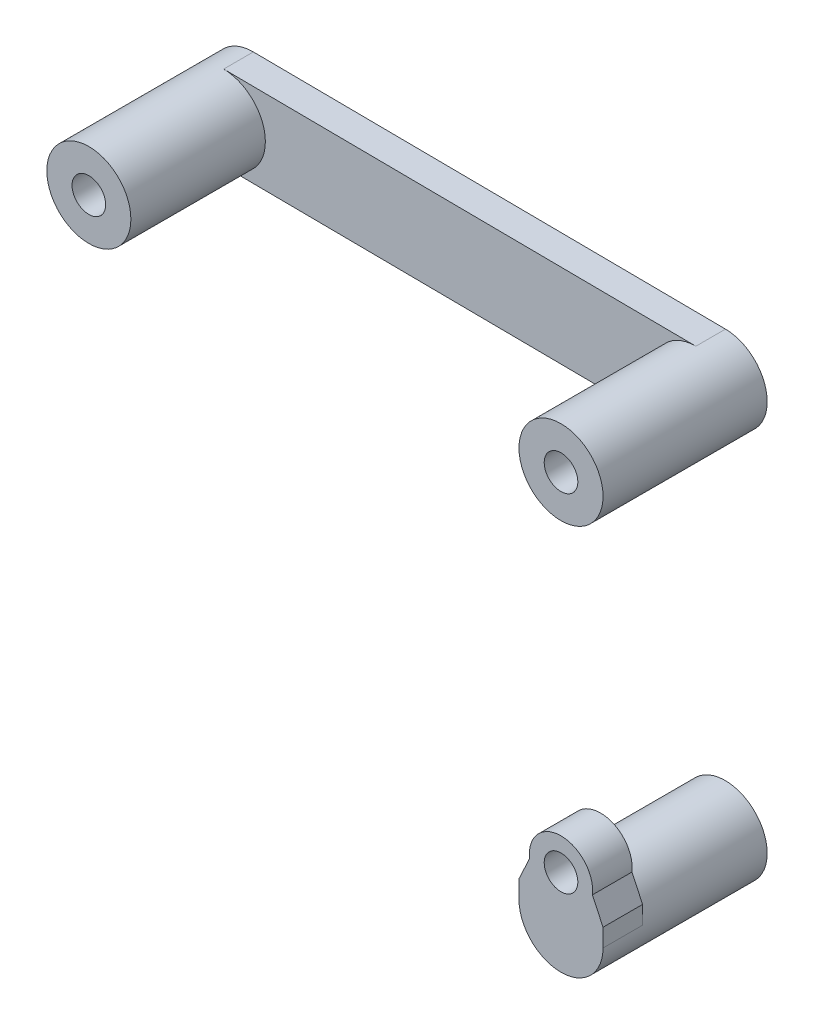
ISO-10303-21;
HEADER;
FILE_DESCRIPTION(('STEP AP214'),'2;1');
FILE_NAME('part.step','',(''),(''),'','','');
FILE_SCHEMA(('AUTOMOTIVE_DESIGN { 1 0 10303 214 1 1 1 1 }'));
ENDSEC;
DATA;
#1=APPLICATION_CONTEXT('core data for automotive mechanical design processes');
#2=APPLICATION_PROTOCOL_DEFINITION('international standard','automotive_design',2000,#1);
#3=PRODUCT_CONTEXT('',#1,'mechanical');
#4=PRODUCT('Part','Part','',(#3));
#5=PRODUCT_RELATED_PRODUCT_CATEGORY('part','',(#4));
#6=PRODUCT_DEFINITION_FORMATION('','',#4);
#7=PRODUCT_DEFINITION_CONTEXT('part definition',#1,'design');
#8=PRODUCT_DEFINITION('design','',#6,#7);
#9=PRODUCT_DEFINITION_SHAPE('','',#8);
#10=(LENGTH_UNIT() NAMED_UNIT(*) SI_UNIT(.MILLI.,.METRE.));
#11=(NAMED_UNIT(*) PLANE_ANGLE_UNIT() SI_UNIT($,.RADIAN.));
#12=(NAMED_UNIT(*) SI_UNIT($,.STERADIAN.) SOLID_ANGLE_UNIT());
#13=UNCERTAINTY_MEASURE_WITH_UNIT(LENGTH_MEASURE(1.E-05),#10,'distance_accuracy_value','');
#14=(GEOMETRIC_REPRESENTATION_CONTEXT(3) GLOBAL_UNCERTAINTY_ASSIGNED_CONTEXT((#13)) GLOBAL_UNIT_ASSIGNED_CONTEXT((#10,
#11,#12)) REPRESENTATION_CONTEXT('',''));
#15=CARTESIAN_POINT('',(0.,0.,0.));
#16=DIRECTION('',(0.,0.,1.));
#17=DIRECTION('',(1.,0.,0.));
#18=AXIS2_PLACEMENT_3D('',#15,#16,#17);
#19=CARTESIAN_POINT('',(77.375,15.9832501717132,0.));
#20=DIRECTION('',(0.,0.,-1.));
#21=DIRECTION('',(-1.,0.,0.));
#22=AXIS2_PLACEMENT_3D('',#19,#20,#21);
#23=PLANE('',#22);
#24=CARTESIAN_POINT('',(77.375,15.9832501717132,0.));
#25=DIRECTION('',(0.,0.,-1.));
#26=DIRECTION('',(-1.,0.,0.));
#27=AXIS2_PLACEMENT_3D('',#24,#25,#26);
#28=CIRCLE('',#27,2.1);
#29=CARTESIAN_POINT('',(75.275,15.9832501717132,0.));
#30=VERTEX_POINT('',#29);
#31=EDGE_CURVE('E124',#30,#30,#28,.T.);
#32=ORIENTED_EDGE('',*,*,#31,.F.);
#33=EDGE_LOOP('',(#32));
#34=FACE_BOUND('',#33,.T.);
#35=CARTESIAN_POINT('',(29.625,16.3832501717124,0.));
#36=DIRECTION('',(0.,0.,-1.));
#37=DIRECTION('',(-1.,0.,0.));
#38=AXIS2_PLACEMENT_3D('',#35,#36,#37);
#39=CIRCLE('',#38,2.1);
#40=CARTESIAN_POINT('',(27.525,16.3832501717124,0.));
#41=VERTEX_POINT('',#40);
#42=EDGE_CURVE('E133',#41,#41,#39,.T.);
#43=ORIENTED_EDGE('',*,*,#42,.F.);
#44=EDGE_LOOP('',(#43));
#45=FACE_BOUND('',#44,.T.);
#46=CARTESIAN_POINT('',(77.375,15.9832501717132,0.));
#47=DIRECTION('',(0.,0.,-1.));
#48=DIRECTION('',(-1.,0.,0.));
#49=AXIS2_PLACEMENT_3D('',#46,#47,#48);
#50=CIRCLE('',#49,4.25000000000001);
#51=CARTESIAN_POINT('',(77.4106008451444,20.2331010608415,0.));
#52=VERTEX_POINT('',#51);
#53=CARTESIAN_POINT('',(77.3393991548555,11.7333992825848,0.));
#54=VERTEX_POINT('',#53);
#55=EDGE_CURVE('E109',#52,#54,#50,.T.);
#56=ORIENTED_EDGE('',*,*,#55,.T.);
#57=DIRECTION('',(-0.999964915089023,0.00837666944575508,0.));
#58=VECTOR('',#57,1.);
#59=CARTESIAN_POINT('',(77.3393991548555,11.7333992825848,0.));
#60=LINE('',#59,#58);
#61=CARTESIAN_POINT('',(29.5893991548555,12.133399282584,0.));
#62=VERTEX_POINT('',#61);
#63=EDGE_CURVE('E143',#54,#62,#60,.T.);
#64=ORIENTED_EDGE('',*,*,#63,.T.);
#65=CARTESIAN_POINT('',(29.625,16.3832501717124,0.));
#66=DIRECTION('',(0.,0.,-1.));
#67=DIRECTION('',(-1.,0.,0.));
#68=AXIS2_PLACEMENT_3D('',#65,#66,#67);
#69=CIRCLE('',#68,4.24999999999999);
#70=CARTESIAN_POINT('',(29.6606008451444,20.6331010608407,0.));
#71=VERTEX_POINT('',#70);
#72=EDGE_CURVE('E53',#62,#71,#69,.T.);
#73=ORIENTED_EDGE('',*,*,#72,.T.);
#74=DIRECTION('',(0.999964915089023,-0.00837666944575472,0.));
#75=VECTOR('',#74,1.);
#76=CARTESIAN_POINT('',(77.4106008451444,20.2331010608415,0.));
#77=LINE('',#76,#75);
#78=EDGE_CURVE('E119',#71,#52,#77,.T.);
#79=ORIENTED_EDGE('',*,*,#78,.T.);
#80=EDGE_LOOP('',(#56,#64,#73,#79));
#81=FACE_BOUND('',#80,.T.);
#82=ADVANCED_FACE('F50',(#34,#45,#81),#23,.T.);
#83=CARTESIAN_POINT('',(77.375,15.9832501717132,28.620815280171));
#84=DIRECTION('',(0.,0.,-1.));
#85=DIRECTION('',(-1.,0.,0.));
#86=AXIS2_PLACEMENT_3D('',#83,#84,#85);
#87=CYLINDRICAL_SURFACE('',#86,4.25);
#88=CARTESIAN_POINT('',(77.375,15.9832501717132,3.));
#89=DIRECTION('',(0.,0.,1.));
#90=DIRECTION('',(1.,0.,0.));
#91=AXIS2_PLACEMENT_3D('',#88,#89,#90);
#92=CIRCLE('',#91,4.25);
#93=CARTESIAN_POINT('',(77.4106008451444,20.2331010608415,3.));
#94=VERTEX_POINT('',#93);
#95=CARTESIAN_POINT('',(77.3393991548555,11.7333992825848,3.));
#96=VERTEX_POINT('',#95);
#97=EDGE_CURVE('E86',#94,#96,#92,.T.);
#98=ORIENTED_EDGE('',*,*,#97,.T.);
#99=DIRECTION('',(0.,0.,1.));
#100=VECTOR('',#99,1.);
#101=CARTESIAN_POINT('',(77.3393991548555,11.7333992825848,-69.4818334965867));
#102=LINE('',#101,#100);
#103=EDGE_CURVE('E13',#54,#96,#102,.T.);
#104=ORIENTED_EDGE('',*,*,#103,.F.);
#105=ORIENTED_EDGE('',*,*,#55,.F.);
#106=DIRECTION('',(0.,0.,-1.));
#107=VECTOR('',#106,1.);
#108=CARTESIAN_POINT('',(77.4106008451444,20.2331010608415,51.6422863653137));
#109=LINE('',#108,#107);
#110=EDGE_CURVE('E101',#94,#52,#109,.T.);
#111=ORIENTED_EDGE('',*,*,#110,.F.);
#112=EDGE_LOOP('',(#98,#104,#105,#111));
#113=FACE_BOUND('',#112,.T.);
#114=CARTESIAN_POINT('',(77.375,15.9832501717132,16.5999999999992));
#115=DIRECTION('',(0.,0.,-1.));
#116=DIRECTION('',(0.,1.,0.));
#117=AXIS2_PLACEMENT_3D('',#114,#115,#116);
#118=CIRCLE('',#117,4.25);
#119=CARTESIAN_POINT('',(77.375,20.2332501717132,16.5999999999991));
#120=VERTEX_POINT('',#119);
#121=EDGE_CURVE('E95',#120,#120,#118,.T.);
#122=ORIENTED_EDGE('',*,*,#121,.T.);
#123=EDGE_LOOP('',(#122));
#124=FACE_BOUND('',#123,.T.);
#125=ADVANCED_FACE('F106',(#113,#124),#87,.T.);
#126=CARTESIAN_POINT('',(53.5000000000003,-1.31674982828628,16.5999999999997));
#127=DIRECTION('',(0.,0.,-1.));
#128=DIRECTION('',(1.,0.,0.));
#129=AXIS2_PLACEMENT_3D('',#126,#127,#128);
#130=PLANE('',#129);
#131=CARTESIAN_POINT('',(77.375,15.9832501717132,16.6000000000002));
#132=DIRECTION('',(0.,0.,1.));
#133=DIRECTION('',(-1.,0.,0.));
#134=AXIS2_PLACEMENT_3D('',#131,#132,#133);
#135=CIRCLE('',#134,1.7);
#136=CARTESIAN_POINT('',(75.675,15.9832501717132,16.6000000000002));
#137=VERTEX_POINT('',#136);
#138=EDGE_CURVE('E125',#137,#137,#135,.T.);
#139=ORIENTED_EDGE('',*,*,#138,.F.);
#140=EDGE_LOOP('',(#139));
#141=FACE_BOUND('',#140,.T.);
#142=ORIENTED_EDGE('',*,*,#121,.F.);
#143=EDGE_LOOP('',(#142));
#144=FACE_BOUND('',#143,.T.);
#145=ADVANCED_FACE('F157',(#141,#144),#130,.F.);
#146=CARTESIAN_POINT('',(0.,0.,3.));
#147=DIRECTION('',(0.,0.,1.));
#148=DIRECTION('',(1.,0.,0.));
#149=AXIS2_PLACEMENT_3D('',#146,#147,#148);
#150=PLANE('',#149);
#151=DIRECTION('',(-0.999964915089023,0.00837666944575472,0.));
#152=VECTOR('',#151,1.);
#153=CARTESIAN_POINT('',(29.5893991548555,12.133399282584,3.));
#154=LINE('',#153,#152);
#155=CARTESIAN_POINT('',(29.5893991548555,12.133399282584,3.));
#156=VERTEX_POINT('',#155);
#157=EDGE_CURVE('E67',#96,#156,#154,.T.);
#158=ORIENTED_EDGE('',*,*,#157,.F.);
#159=ORIENTED_EDGE('',*,*,#97,.F.);
#160=DIRECTION('',(0.999964915089023,-0.00837666944575472,0.));
#161=VECTOR('',#160,1.);
#162=CARTESIAN_POINT('',(77.4106008451444,20.2331010608415,3.));
#163=LINE('',#162,#161);
#164=CARTESIAN_POINT('',(29.6606008451444,20.6331010608407,3.));
#165=VERTEX_POINT('',#164);
#166=EDGE_CURVE('E89',#165,#94,#163,.T.);
#167=ORIENTED_EDGE('',*,*,#166,.F.);
#168=CARTESIAN_POINT('',(29.625,16.3832501717124,3.));
#169=DIRECTION('',(0.,0.,1.));
#170=DIRECTION('',(1.,0.,0.));
#171=AXIS2_PLACEMENT_3D('',#168,#169,#170);
#172=CIRCLE('',#171,4.25);
#173=EDGE_CURVE('E150',#156,#165,#172,.T.);
#174=ORIENTED_EDGE('',*,*,#173,.F.);
#175=EDGE_LOOP('',(#158,#159,#167,#174));
#176=FACE_BOUND('',#175,.T.);
#177=ADVANCED_FACE('F88',(#176),#150,.T.);
#178=CARTESIAN_POINT('',(29.625,16.3832501717124,28.620815280171));
#179=DIRECTION('',(0.,0.,-1.));
#180=DIRECTION('',(-1.,0.,0.));
#181=AXIS2_PLACEMENT_3D('',#178,#179,#180);
#182=CYLINDRICAL_SURFACE('',#181,4.25);
#183=DIRECTION('',(0.,0.,1.));
#184=VECTOR('',#183,1.);
#185=CARTESIAN_POINT('',(29.5893991548555,12.133399282584,-69.4818334965867));
#186=LINE('',#185,#184);
#187=EDGE_CURVE('E59',#62,#156,#186,.T.);
#188=ORIENTED_EDGE('',*,*,#187,.T.);
#189=ORIENTED_EDGE('',*,*,#173,.T.);
#190=DIRECTION('',(0.,0.,-1.));
#191=VECTOR('',#190,1.);
#192=CARTESIAN_POINT('',(29.6606008451444,20.6331010608407,51.6422863653137));
#193=LINE('',#192,#191);
#194=EDGE_CURVE('E104',#165,#71,#193,.T.);
#195=ORIENTED_EDGE('',*,*,#194,.T.);
#196=ORIENTED_EDGE('',*,*,#72,.F.);
#197=EDGE_LOOP('',(#188,#189,#195,#196));
#198=FACE_BOUND('',#197,.T.);
#199=CARTESIAN_POINT('',(29.625,16.3832501717124,16.5999999999997));
#200=DIRECTION('',(0.,0.,-1.));
#201=DIRECTION('',(0.,1.,0.));
#202=AXIS2_PLACEMENT_3D('',#199,#200,#201);
#203=CIRCLE('',#202,4.25);
#204=CARTESIAN_POINT('',(29.625,20.6332501717124,16.5999999999996));
#205=VERTEX_POINT('',#204);
#206=EDGE_CURVE('E94',#205,#205,#203,.T.);
#207=ORIENTED_EDGE('',*,*,#206,.T.);
#208=EDGE_LOOP('',(#207));
#209=FACE_BOUND('',#208,.T.);
#210=ADVANCED_FACE('F148',(#198,#209),#182,.T.);
#211=CARTESIAN_POINT('',(53.5000000000003,-1.31674982828628,16.5999999999997));
#212=DIRECTION('',(0.,0.,-1.));
#213=DIRECTION('',(1.,0.,0.));
#214=AXIS2_PLACEMENT_3D('',#211,#212,#213);
#215=PLANE('',#214);
#216=CARTESIAN_POINT('',(29.625,16.3832501717124,16.6000000000002));
#217=DIRECTION('',(0.,0.,1.));
#218=DIRECTION('',(1.,0.,0.));
#219=AXIS2_PLACEMENT_3D('',#216,#217,#218);
#220=CIRCLE('',#219,1.7);
#221=CARTESIAN_POINT('',(31.325,16.3832501717124,16.6000000000002));
#222=VERTEX_POINT('',#221);
#223=EDGE_CURVE('E110',#222,#222,#220,.T.);
#224=ORIENTED_EDGE('',*,*,#223,.F.);
#225=EDGE_LOOP('',(#224));
#226=FACE_BOUND('',#225,.T.);
#227=ORIENTED_EDGE('',*,*,#206,.F.);
#228=EDGE_LOOP('',(#227));
#229=FACE_BOUND('',#228,.T.);
#230=ADVANCED_FACE('F216',(#226,#229),#215,.F.);
#231=CARTESIAN_POINT('',(29.5893991548555,12.133399282584,51.6422863653137));
#232=DIRECTION('',(-0.00837666944575472,-0.999964915089023,0.));
#233=DIRECTION('',(0.999964915089023,-0.00837666944575472,0.));
#234=AXIS2_PLACEMENT_3D('',#231,#232,#233);
#235=PLANE('',#234);
#236=ORIENTED_EDGE('',*,*,#187,.F.);
#237=ORIENTED_EDGE('',*,*,#63,.F.);
#238=ORIENTED_EDGE('',*,*,#103,.T.);
#239=ORIENTED_EDGE('',*,*,#157,.T.);
#240=EDGE_LOOP('',(#236,#237,#238,#239));
#241=FACE_BOUND('',#240,.T.);
#242=ADVANCED_FACE('F213',(#241),#235,.T.);
#243=CARTESIAN_POINT('',(77.4106008451444,20.2331010608415,51.6422863653137));
#244=DIRECTION('',(0.00837666944575472,0.999964915089023,0.));
#245=DIRECTION('',(-0.999964915089023,0.00837666944575472,0.));
#246=AXIS2_PLACEMENT_3D('',#243,#244,#245);
#247=PLANE('',#246);
#248=ORIENTED_EDGE('',*,*,#194,.F.);
#249=ORIENTED_EDGE('',*,*,#166,.T.);
#250=ORIENTED_EDGE('',*,*,#110,.T.);
#251=ORIENTED_EDGE('',*,*,#78,.F.);
#252=EDGE_LOOP('',(#248,#249,#250,#251));
#253=FACE_BOUND('',#252,.T.);
#254=ADVANCED_FACE('F99',(#253),#247,.T.);
#255=CARTESIAN_POINT('',(29.625,16.3832501717124,12.6000000000002));
#256=DIRECTION('',(0.,0.,1.));
#257=DIRECTION('',(1.,0.,0.));
#258=AXIS2_PLACEMENT_3D('',#255,#256,#257);
#259=CYLINDRICAL_SURFACE('',#258,1.7);
#260=CARTESIAN_POINT('',(29.625,16.3832501717124,12.6000000000002));
#261=DIRECTION('',(0.,0.,1.));
#262=DIRECTION('',(1.,0.,0.));
#263=AXIS2_PLACEMENT_3D('',#260,#261,#262);
#264=CIRCLE('',#263,1.7);
#265=CARTESIAN_POINT('',(31.325,16.3832501717124,12.6000000000002));
#266=VERTEX_POINT('',#265);
#267=EDGE_CURVE('E113',#266,#266,#264,.T.);
#268=ORIENTED_EDGE('',*,*,#267,.F.);
#269=EDGE_LOOP('',(#268));
#270=FACE_BOUND('',#269,.T.);
#271=ORIENTED_EDGE('',*,*,#223,.T.);
#272=EDGE_LOOP('',(#271));
#273=FACE_BOUND('',#272,.T.);
#274=ADVANCED_FACE('F200',(#270,#273),#259,.F.);
#275=CARTESIAN_POINT('',(29.625,16.3832501717124,12.6000000000002));
#276=DIRECTION('',(0.,0.,1.));
#277=DIRECTION('',(1.,0.,0.));
#278=AXIS2_PLACEMENT_3D('',#275,#276,#277);
#279=PLANE('',#278);
#280=ORIENTED_EDGE('',*,*,#267,.T.);
#281=EDGE_LOOP('',(#280));
#282=FACE_BOUND('',#281,.T.);
#283=ADVANCED_FACE('F196',(#282),#279,.T.);
#284=CARTESIAN_POINT('',(77.375,15.9832501717132,12.6000000000002));
#285=DIRECTION('',(0.,0.,1.));
#286=DIRECTION('',(1.,0.,0.));
#287=AXIS2_PLACEMENT_3D('',#284,#285,#286);
#288=CYLINDRICAL_SURFACE('',#287,1.7);
#289=CARTESIAN_POINT('',(77.375,15.9832501717132,12.6000000000002));
#290=DIRECTION('',(0.,0.,1.));
#291=DIRECTION('',(-1.,0.,0.));
#292=AXIS2_PLACEMENT_3D('',#289,#290,#291);
#293=CIRCLE('',#292,1.7);
#294=CARTESIAN_POINT('',(75.675,15.9832501717132,12.6000000000002));
#295=VERTEX_POINT('',#294);
#296=EDGE_CURVE('E121',#295,#295,#293,.T.);
#297=ORIENTED_EDGE('',*,*,#296,.F.);
#298=EDGE_LOOP('',(#297));
#299=FACE_BOUND('',#298,.T.);
#300=ORIENTED_EDGE('',*,*,#138,.T.);
#301=EDGE_LOOP('',(#300));
#302=FACE_BOUND('',#301,.T.);
#303=ADVANCED_FACE('F199',(#299,#302),#288,.F.);
#304=CARTESIAN_POINT('',(77.375,15.9832501717132,12.6000000000002));
#305=DIRECTION('',(0.,0.,-1.));
#306=DIRECTION('',(-1.,0.,0.));
#307=AXIS2_PLACEMENT_3D('',#304,#305,#306);
#308=PLANE('',#307);
#309=ORIENTED_EDGE('',*,*,#296,.T.);
#310=EDGE_LOOP('',(#309));
#311=FACE_BOUND('',#310,.T.);
#312=ADVANCED_FACE('F193',(#311),#308,.F.);
#313=CARTESIAN_POINT('',(77.375,15.9832501717132,5.7));
#314=DIRECTION('',(0.,0.,-1.));
#315=DIRECTION('',(-1.,0.,0.));
#316=AXIS2_PLACEMENT_3D('',#313,#314,#315);
#317=CYLINDRICAL_SURFACE('',#316,2.1);
#318=CARTESIAN_POINT('',(77.375,15.9832501717132,5.7));
#319=DIRECTION('',(0.,0.,-1.));
#320=DIRECTION('',(-1.,0.,0.));
#321=AXIS2_PLACEMENT_3D('',#318,#319,#320);
#322=CIRCLE('',#321,2.1);
#323=CARTESIAN_POINT('',(75.275,15.9832501717132,5.7));
#324=VERTEX_POINT('',#323);
#325=EDGE_CURVE('E130',#324,#324,#322,.T.);
#326=ORIENTED_EDGE('',*,*,#325,.F.);
#327=EDGE_LOOP('',(#326));
#328=FACE_BOUND('',#327,.T.);
#329=ORIENTED_EDGE('',*,*,#31,.T.);
#330=EDGE_LOOP('',(#329));
#331=FACE_BOUND('',#330,.T.);
#332=ADVANCED_FACE('F187',(#328,#331),#317,.F.);
#333=CARTESIAN_POINT('',(77.375,15.9832501717132,5.7));
#334=DIRECTION('',(0.,0.,-1.));
#335=DIRECTION('',(-1.,0.,0.));
#336=AXIS2_PLACEMENT_3D('',#333,#334,#335);
#337=PLANE('',#336);
#338=ORIENTED_EDGE('',*,*,#325,.T.);
#339=EDGE_LOOP('',(#338));
#340=FACE_BOUND('',#339,.T.);
#341=ADVANCED_FACE('F179',(#340),#337,.T.);
#342=CARTESIAN_POINT('',(29.625,16.3832501717124,5.7));
#343=DIRECTION('',(0.,0.,-1.));
#344=DIRECTION('',(-1.,0.,0.));
#345=AXIS2_PLACEMENT_3D('',#342,#343,#344);
#346=CYLINDRICAL_SURFACE('',#345,2.1);
#347=CARTESIAN_POINT('',(29.625,16.3832501717124,5.7));
#348=DIRECTION('',(0.,0.,-1.));
#349=DIRECTION('',(-1.,0.,0.));
#350=AXIS2_PLACEMENT_3D('',#347,#348,#349);
#351=CIRCLE('',#350,2.1);
#352=CARTESIAN_POINT('',(27.525,16.3832501717124,5.7));
#353=VERTEX_POINT('',#352);
#354=EDGE_CURVE('E138',#353,#353,#351,.T.);
#355=ORIENTED_EDGE('',*,*,#354,.F.);
#356=EDGE_LOOP('',(#355));
#357=FACE_BOUND('',#356,.T.);
#358=ORIENTED_EDGE('',*,*,#42,.T.);
#359=EDGE_LOOP('',(#358));
#360=FACE_BOUND('',#359,.T.);
#361=ADVANCED_FACE('F176',(#357,#360),#346,.F.);
#362=CARTESIAN_POINT('',(29.625,16.3832501717124,5.7));
#363=DIRECTION('',(0.,0.,-1.));
#364=DIRECTION('',(-1.,0.,0.));
#365=AXIS2_PLACEMENT_3D('',#362,#363,#364);
#366=PLANE('',#365);
#367=ORIENTED_EDGE('',*,*,#354,.T.);
#368=EDGE_LOOP('',(#367));
#369=FACE_BOUND('',#368,.T.);
#370=ADVANCED_FACE('F178',(#369),#366,.T.);
#371=CLOSED_SHELL('',(#82,#125,#145,#177,#210,#230,#242,#254,#274,#283,#303,#312,#332,#341,#361,#370));
#372=MANIFOLD_SOLID_BREP('B2',#371);
#373=CARTESIAN_POINT('',(77.3750000000006,-23.5667498282858,5.7));
#374=DIRECTION('',(0.,0.,-1.));
#375=DIRECTION('',(-1.,0.,0.));
#376=AXIS2_PLACEMENT_3D('',#373,#374,#375);
#377=PLANE('',#376);
#378=CARTESIAN_POINT('',(77.3750000000006,-23.5667498282858,5.7));
#379=DIRECTION('',(0.,0.,-1.));
#380=DIRECTION('',(-1.,0.,0.));
#381=AXIS2_PLACEMENT_3D('',#378,#379,#380);
#382=CIRCLE('',#381,2.09999999999968);
#383=CARTESIAN_POINT('',(75.2750000000009,-23.5667498282858,5.7));
#384=VERTEX_POINT('',#383);
#385=EDGE_CURVE('E575',#384,#384,#382,.T.);
#386=ORIENTED_EDGE('',*,*,#385,.T.);
#387=EDGE_LOOP('',(#386));
#388=FACE_BOUND('',#387,.T.);
#389=ADVANCED_FACE('F386',(#388),#377,.T.);
#390=CARTESIAN_POINT('',(77.3750000000006,-19.0667498282868,12.6000000000002));
#391=DIRECTION('',(0.,0.,1.));
#392=DIRECTION('',(1.,0.,0.));
#393=AXIS2_PLACEMENT_3D('',#390,#391,#392);
#394=CYLINDRICAL_SURFACE('',#393,1.7);
#395=CARTESIAN_POINT('',(77.3750000000006,-19.0667498282868,12.6000000000002));
#396=DIRECTION('',(0.,0.,1.));
#397=DIRECTION('',(-1.,0.,0.));
#398=AXIS2_PLACEMENT_3D('',#395,#396,#397);
#399=CIRCLE('',#398,1.7);
#400=CARTESIAN_POINT('',(75.7713429380878,-19.6309164949529,12.5999999999997));
#401=VERTEX_POINT('',#400);
#402=CARTESIAN_POINT('',(78.9786570619134,-19.6309164949529,12.6000000000002));
#403=VERTEX_POINT('',#402);
#404=EDGE_CURVE('E444',#401,#403,#399,.T.);
#405=ORIENTED_EDGE('',*,*,#404,.F.);
#406=CARTESIAN_POINT('',(77.3750000000006,-19.0667498282868,12.5999999999997));
#407=DIRECTION('',(0.,0.,-1.));
#408=DIRECTION('',(0.,1.,0.));
#409=AXIS2_PLACEMENT_3D('',#406,#407,#408);
#410=CIRCLE('',#409,1.7);
#411=EDGE_CURVE('E440',#401,#403,#410,.T.);
#412=ORIENTED_EDGE('',*,*,#411,.T.);
#413=EDGE_LOOP('',(#405,#412));
#414=FACE_BOUND('',#413,.T.);
#415=CARTESIAN_POINT('',(77.3750000000006,-19.0667498282868,16.6000000000002));
#416=DIRECTION('',(0.,0.,1.));
#417=DIRECTION('',(-1.,0.,0.));
#418=AXIS2_PLACEMENT_3D('',#415,#416,#417);
#419=CIRCLE('',#418,1.7);
#420=CARTESIAN_POINT('',(75.6750000000006,-19.0667498282868,16.6000000000002));
#421=VERTEX_POINT('',#420);
#422=EDGE_CURVE('E456',#421,#421,#419,.T.);
#423=ORIENTED_EDGE('',*,*,#422,.T.);
#424=EDGE_LOOP('',(#423));
#425=FACE_BOUND('',#424,.T.);
#426=ADVANCED_FACE('F442',(#414,#425),#394,.F.);
#427=CARTESIAN_POINT('',(77.3750000000006,-23.5667498282858,5.7));
#428=DIRECTION('',(0.,0.,-1.));
#429=DIRECTION('',(-1.,0.,0.));
#430=AXIS2_PLACEMENT_3D('',#427,#428,#429);
#431=CYLINDRICAL_SURFACE('',#430,2.09999999999968);
#432=ORIENTED_EDGE('',*,*,#385,.F.);
#433=EDGE_LOOP('',(#432));
#434=FACE_BOUND('',#433,.T.);
#435=CARTESIAN_POINT('',(77.3750000000006,-23.5667498282858,0.));
#436=DIRECTION('',(0.,0.,-1.));
#437=DIRECTION('',(-1.,0.,0.));
#438=AXIS2_PLACEMENT_3D('',#435,#436,#437);
#439=CIRCLE('',#438,2.09999999999968);
#440=CARTESIAN_POINT('',(75.2750000000009,-23.5667498282858,0.));
#441=VERTEX_POINT('',#440);
#442=EDGE_CURVE('E457',#441,#441,#439,.T.);
#443=ORIENTED_EDGE('',*,*,#442,.T.);
#444=EDGE_LOOP('',(#443));
#445=FACE_BOUND('',#444,.T.);
#446=ADVANCED_FACE('F535',(#434,#445),#431,.F.);
#447=CARTESIAN_POINT('',(53.5000000000003,-1.31674982828628,16.5999999999997));
#448=DIRECTION('',(0.,0.,-1.));
#449=DIRECTION('',(1.,0.,0.));
#450=AXIS2_PLACEMENT_3D('',#447,#448,#449);
#451=PLANE('',#450);
#452=ORIENTED_EDGE('',*,*,#422,.F.);
#453=EDGE_LOOP('',(#452));
#454=FACE_BOUND('',#453,.T.);
#455=CARTESIAN_POINT('',(77.3750000000006,-19.0667498282868,16.6000000000002));
#456=DIRECTION('',(0.,0.,-1.));
#457=DIRECTION('',(-1.,0.,0.));
#458=AXIS2_PLACEMENT_3D('',#455,#456,#457);
#459=CIRCLE('',#458,3.19999999999999);
#460=CARTESIAN_POINT('',(74.1976753750778,-19.4470237136106,16.5999999999997));
#461=VERTEX_POINT('',#460);
#462=CARTESIAN_POINT('',(80.5523246249234,-19.4470237136106,16.5999999999996));
#463=VERTEX_POINT('',#462);
#464=EDGE_CURVE('E507',#461,#463,#459,.T.);
#465=ORIENTED_EDGE('',*,*,#464,.F.);
#466=DIRECTION('',(-0.422618261740695,-0.906307787036652,0.));
#467=VECTOR('',#466,1.);
#468=CARTESIAN_POINT('',(74.3750000000007,-19.0667498282866,16.5999999999997));
#469=LINE('',#468,#467);
#470=CARTESIAN_POINT('',(73.1250000000006,-21.7473834789238,16.6000000000002));
#471=VERTEX_POINT('',#470);
#472=EDGE_CURVE('E492',#461,#471,#469,.T.);
#473=ORIENTED_EDGE('',*,*,#472,.T.);
#474=DIRECTION('',(0.,-1.,0.));
#475=VECTOR('',#474,1.);
#476=CARTESIAN_POINT('',(73.1250000000006,-19.0667498282868,16.6000000000002));
#477=LINE('',#476,#475);
#478=CARTESIAN_POINT('',(73.1250000000006,-23.5667498282858,16.6000000000002));
#479=VERTEX_POINT('',#478);
#480=EDGE_CURVE('E470',#471,#479,#477,.T.);
#481=ORIENTED_EDGE('',*,*,#480,.T.);
#482=CARTESIAN_POINT('',(77.3750000000006,-23.5667498282858,16.6000000000002));
#483=DIRECTION('',(0.,0.,1.));
#484=DIRECTION('',(1.,0.,0.));
#485=AXIS2_PLACEMENT_3D('',#482,#483,#484);
#486=CIRCLE('',#485,4.24999999999998);
#487=CARTESIAN_POINT('',(81.6250000000006,-23.5667498282858,16.6000000000002));
#488=VERTEX_POINT('',#487);
#489=EDGE_CURVE('E477',#479,#488,#486,.T.);
#490=ORIENTED_EDGE('',*,*,#489,.T.);
#491=DIRECTION('',(0.,1.,0.));
#492=VECTOR('',#491,1.);
#493=CARTESIAN_POINT('',(81.6250000000006,-19.0667498282868,16.6000000000002));
#494=LINE('',#493,#492);
#495=CARTESIAN_POINT('',(81.6250000000006,-21.7473834789238,16.6000000000002));
#496=VERTEX_POINT('',#495);
#497=EDGE_CURVE('E473',#488,#496,#494,.T.);
#498=ORIENTED_EDGE('',*,*,#497,.T.);
#499=DIRECTION('',(-0.4226182617407,0.90630778703665,0.));
#500=VECTOR('',#499,1.);
#501=CARTESIAN_POINT('',(81.6250000000005,-21.7473834789237,16.5999999999996));
#502=LINE('',#501,#500);
#503=EDGE_CURVE('E489',#496,#463,#502,.T.);
#504=ORIENTED_EDGE('',*,*,#503,.T.);
#505=EDGE_LOOP('',(#465,#473,#481,#490,#498,#504));
#506=FACE_BOUND('',#505,.T.);
#507=ADVANCED_FACE('F513',(#454,#506),#451,.F.);
#508=CARTESIAN_POINT('',(81.6250000000006,-19.0667498282868,-2.93222456700938));
#509=DIRECTION('',(1.,0.,0.));
#510=DIRECTION('',(0.,1.,0.));
#511=AXIS2_PLACEMENT_3D('',#508,#509,#510);
#512=PLANE('',#511);
#513=DIRECTION('',(0.,1.,0.));
#514=VECTOR('',#513,1.);
#515=CARTESIAN_POINT('',(81.6250000000006,-19.0667498282866,12.5999999999996));
#516=LINE('',#515,#514);
#517=CARTESIAN_POINT('',(81.6250000000004,-23.5667498282858,12.5999999999997));
#518=VERTEX_POINT('',#517);
#519=CARTESIAN_POINT('',(81.6250000000006,-21.7473834789238,12.5999999999996));
#520=VERTEX_POINT('',#519);
#521=EDGE_CURVE('E450',#518,#520,#516,.T.);
#522=ORIENTED_EDGE('',*,*,#521,.T.);
#523=DIRECTION('',(0.,0.,1.));
#524=VECTOR('',#523,1.);
#525=CARTESIAN_POINT('',(81.6250000000006,-21.7473834789238,16.6000000000002));
#526=LINE('',#525,#524);
#527=EDGE_CURVE('E501',#520,#496,#526,.T.);
#528=ORIENTED_EDGE('',*,*,#527,.T.);
#529=ORIENTED_EDGE('',*,*,#497,.F.);
#530=DIRECTION('',(0.,0.,1.));
#531=VECTOR('',#530,1.);
#532=CARTESIAN_POINT('',(81.6250000000006,-23.5667498282858,-2.93222456700938));
#533=LINE('',#532,#531);
#534=EDGE_CURVE('E484',#518,#488,#533,.T.);
#535=ORIENTED_EDGE('',*,*,#534,.F.);
#536=EDGE_LOOP('',(#522,#528,#529,#535));
#537=FACE_BOUND('',#536,.T.);
#538=ADVANCED_FACE('F520',(#537),#512,.T.);
#539=CARTESIAN_POINT('',(77.3750000000006,-19.0667498282868,12.6000000000002));
#540=DIRECTION('',(0.,0.,-1.));
#541=DIRECTION('',(-1.,0.,0.));
#542=AXIS2_PLACEMENT_3D('',#539,#540,#541);
#543=PLANE('',#542);
#544=CARTESIAN_POINT('',(77.3750000000006,-23.5667498282858,12.5999999999997));
#545=DIRECTION('',(0.,0.,-1.));
#546=DIRECTION('',(0.,1.,0.));
#547=AXIS2_PLACEMENT_3D('',#544,#545,#546);
#548=CIRCLE('',#547,4.2499999999997);
#549=EDGE_CURVE('E455',#401,#403,#548,.T.);
#550=ORIENTED_EDGE('',*,*,#549,.F.);
#551=ORIENTED_EDGE('',*,*,#404,.T.);
#552=EDGE_LOOP('',(#550,#551));
#553=FACE_BOUND('',#552,.T.);
#554=ADVANCED_FACE('F453',(#553),#543,.F.);
#555=CARTESIAN_POINT('',(53.5000000000002,-1.31674982828633,12.5999999999997));
#556=DIRECTION('',(0.,0.,-1.));
#557=DIRECTION('',(1.,0.,0.));
#558=AXIS2_PLACEMENT_3D('',#555,#556,#557);
#559=PLANE('',#558);
#560=DIRECTION('',(0.422618261740695,0.906307787036652,0.));
#561=VECTOR('',#560,1.);
#562=CARTESIAN_POINT('',(77.4452401087849,-12.4825986673727,12.5999999999996));
#563=LINE('',#562,#561);
#564=CARTESIAN_POINT('',(73.1250000000006,-21.7473834789238,12.5999999999997));
#565=VERTEX_POINT('',#564);
#566=CARTESIAN_POINT('',(74.1976753750778,-19.4470237136106,12.5999999999997));
#567=VERTEX_POINT('',#566);
#568=EDGE_CURVE('E499',#565,#567,#563,.T.);
#569=ORIENTED_EDGE('',*,*,#568,.T.);
#570=CARTESIAN_POINT('',(77.3750000000006,-19.0667498282868,12.5999999999997));
#571=DIRECTION('',(0.,0.,-1.));
#572=DIRECTION('',(0.,1.,0.));
#573=AXIS2_PLACEMENT_3D('',#570,#571,#572);
#574=CIRCLE('',#573,3.19999999999999);
#575=CARTESIAN_POINT('',(80.5523246249234,-19.4470237136106,12.5999999999996));
#576=VERTEX_POINT('',#575);
#577=EDGE_CURVE('E402',#576,#567,#574,.F.);
#578=ORIENTED_EDGE('',*,*,#577,.F.);
#579=DIRECTION('',(0.4226182617407,-0.90630778703665,0.));
#580=VECTOR('',#579,1.);
#581=CARTESIAN_POINT('',(68.7763140724822,5.80671241209301,12.5999999999994));
#582=LINE('',#581,#580);
#583=EDGE_CURVE('E497',#576,#520,#582,.T.);
#584=ORIENTED_EDGE('',*,*,#583,.T.);
#585=ORIENTED_EDGE('',*,*,#521,.F.);
#586=EDGE_CURVE('E460',#403,#518,#548,.T.);
#587=ORIENTED_EDGE('',*,*,#586,.F.);
#588=ORIENTED_EDGE('',*,*,#411,.F.);
#589=CARTESIAN_POINT('',(73.1250000000006,-23.5667498282858,12.5999999999997));
#590=VERTEX_POINT('',#589);
#591=EDGE_CURVE('E467',#590,#401,#548,.T.);
#592=ORIENTED_EDGE('',*,*,#591,.F.);
#593=DIRECTION('',(0.,-1.,0.));
#594=VECTOR('',#593,1.);
#595=CARTESIAN_POINT('',(73.1250000000006,-19.0667498282866,12.5999999999997));
#596=LINE('',#595,#594);
#597=EDGE_CURVE('E476',#565,#590,#596,.T.);
#598=ORIENTED_EDGE('',*,*,#597,.F.);
#599=EDGE_LOOP('',(#569,#578,#584,#585,#587,#588,#592,#598));
#600=FACE_BOUND('',#599,.T.);
#601=ADVANCED_FACE('F461',(#600),#559,.T.);
#602=CARTESIAN_POINT('',(73.1250000000006,-19.0667498282868,-2.93222456700938));
#603=DIRECTION('',(-1.,0.,0.));
#604=DIRECTION('',(0.,-1.,0.));
#605=AXIS2_PLACEMENT_3D('',#602,#603,#604);
#606=PLANE('',#605);
#607=ORIENTED_EDGE('',*,*,#480,.F.);
#608=DIRECTION('',(0.,0.,-1.));
#609=VECTOR('',#608,1.);
#610=CARTESIAN_POINT('',(73.1250000000006,-21.7473834789238,12.5999999999997));
#611=LINE('',#610,#609);
#612=EDGE_CURVE('E494',#471,#565,#611,.T.);
#613=ORIENTED_EDGE('',*,*,#612,.T.);
#614=ORIENTED_EDGE('',*,*,#597,.T.);
#615=DIRECTION('',(0.,0.,1.));
#616=VECTOR('',#615,1.);
#617=CARTESIAN_POINT('',(73.1250000000006,-23.5667498282858,-2.93222456700938));
#618=LINE('',#617,#616);
#619=EDGE_CURVE('E482',#590,#479,#618,.T.);
#620=ORIENTED_EDGE('',*,*,#619,.T.);
#621=EDGE_LOOP('',(#607,#613,#614,#620));
#622=FACE_BOUND('',#621,.T.);
#623=ADVANCED_FACE('F515',(#622),#606,.T.);
#624=CARTESIAN_POINT('',(77.3750000000006,-23.5667498282858,-2.93222456700938));
#625=DIRECTION('',(0.,0.,1.));
#626=DIRECTION('',(1.,0.,0.));
#627=AXIS2_PLACEMENT_3D('',#624,#625,#626);
#628=CYLINDRICAL_SURFACE('',#627,4.24999999999998);
#629=CARTESIAN_POINT('',(77.3750000000006,-23.5667498282858,0.));
#630=DIRECTION('',(0.,0.,1.));
#631=DIRECTION('',(1.,0.,0.));
#632=AXIS2_PLACEMENT_3D('',#629,#630,#631);
#633=CIRCLE('',#632,4.2499999999997);
#634=CARTESIAN_POINT('',(81.6250000000003,-23.5667498282858,0.));
#635=VERTEX_POINT('',#634);
#636=EDGE_CURVE('E465',#635,#635,#633,.F.);
#637=ORIENTED_EDGE('',*,*,#636,.F.);
#638=EDGE_LOOP('',(#637));
#639=FACE_BOUND('',#638,.T.);
#640=ORIENTED_EDGE('',*,*,#619,.F.);
#641=ORIENTED_EDGE('',*,*,#591,.T.);
#642=ORIENTED_EDGE('',*,*,#549,.T.);
#643=ORIENTED_EDGE('',*,*,#586,.T.);
#644=ORIENTED_EDGE('',*,*,#534,.T.);
#645=ORIENTED_EDGE('',*,*,#489,.F.);
#646=EDGE_LOOP('',(#640,#641,#642,#643,#644,#645));
#647=FACE_BOUND('',#646,.T.);
#648=ADVANCED_FACE('F469',(#639,#647),#628,.T.);
#649=CARTESIAN_POINT('',(77.375,15.9832501717132,0.));
#650=DIRECTION('',(0.,0.,-1.));
#651=DIRECTION('',(-1.,0.,0.));
#652=AXIS2_PLACEMENT_3D('',#649,#650,#651);
#653=PLANE('',#652);
#654=ORIENTED_EDGE('',*,*,#442,.F.);
#655=EDGE_LOOP('',(#654));
#656=FACE_BOUND('',#655,.T.);
#657=ORIENTED_EDGE('',*,*,#636,.T.);
#658=EDGE_LOOP('',(#657));
#659=FACE_BOUND('',#658,.T.);
#660=ADVANCED_FACE('F547',(#656,#659),#653,.T.);
#661=CARTESIAN_POINT('',(77.3750000000006,-19.0667498282868,0.));
#662=DIRECTION('',(0.,0.,1.));
#663=DIRECTION('',(1.,0.,0.));
#664=AXIS2_PLACEMENT_3D('',#661,#662,#663);
#665=CYLINDRICAL_SURFACE('',#664,3.19999999999999);
#666=ORIENTED_EDGE('',*,*,#577,.T.);
#667=DIRECTION('',(0.,0.,1.));
#668=VECTOR('',#667,1.);
#669=CARTESIAN_POINT('',(74.1976753750778,-19.4470237136106,14.5999999999997));
#670=LINE('',#669,#668);
#671=EDGE_CURVE('E396',#567,#461,#670,.T.);
#672=ORIENTED_EDGE('',*,*,#671,.T.);
#673=ORIENTED_EDGE('',*,*,#464,.T.);
#674=DIRECTION('',(0.,0.,1.));
#675=VECTOR('',#674,1.);
#676=CARTESIAN_POINT('',(80.5523246249234,-19.4470237136106,14.5999999999996));
#677=LINE('',#676,#675);
#678=EDGE_CURVE('E48',#463,#576,#677,.F.);
#679=ORIENTED_EDGE('',*,*,#678,.T.);
#680=EDGE_LOOP('',(#666,#672,#673,#679));
#681=FACE_BOUND('',#680,.T.);
#682=ADVANCED_FACE('F506',(#681),#665,.T.);
#683=CARTESIAN_POINT('',(74.3750000000006,-19.0667498282868,0.));
#684=DIRECTION('',(-0.906307787036652,0.422618261740695,0.));
#685=DIRECTION('',(0.,0.,-1.));
#686=AXIS2_PLACEMENT_3D('',#683,#684,#685);
#687=PLANE('',#686);
#688=ORIENTED_EDGE('',*,*,#568,.F.);
#689=ORIENTED_EDGE('',*,*,#612,.F.);
#690=ORIENTED_EDGE('',*,*,#472,.F.);
#691=ORIENTED_EDGE('',*,*,#671,.F.);
#692=EDGE_LOOP('',(#688,#689,#690,#691));
#693=FACE_BOUND('',#692,.T.);
#694=ADVANCED_FACE('F510',(#693),#687,.T.);
#695=CARTESIAN_POINT('',(81.6250000000006,-21.7473834789238,-2.93222456700938));
#696=DIRECTION('',(0.90630778703665,0.4226182617407,0.));
#697=DIRECTION('',(0.,0.,-1.));
#698=AXIS2_PLACEMENT_3D('',#695,#696,#697);
#699=PLANE('',#698);
#700=ORIENTED_EDGE('',*,*,#583,.F.);
#701=ORIENTED_EDGE('',*,*,#678,.F.);
#702=ORIENTED_EDGE('',*,*,#503,.F.);
#703=ORIENTED_EDGE('',*,*,#527,.F.);
#704=EDGE_LOOP('',(#700,#701,#702,#703));
#705=FACE_BOUND('',#704,.T.);
#706=ADVANCED_FACE('F389',(#705),#699,.T.);
#707=CLOSED_SHELL('',(#389,#426,#446,#507,#538,#554,#601,#623,#648,#660,#682,#694,#706));
#708=MANIFOLD_SOLID_BREP('B7',#707);
#709=ADVANCED_BREP_SHAPE_REPRESENTATION('',(#18,#372,#708),#14);
#710=SHAPE_DEFINITION_REPRESENTATION(#9,#709);
ENDSEC;
END-ISO-10303-21;
